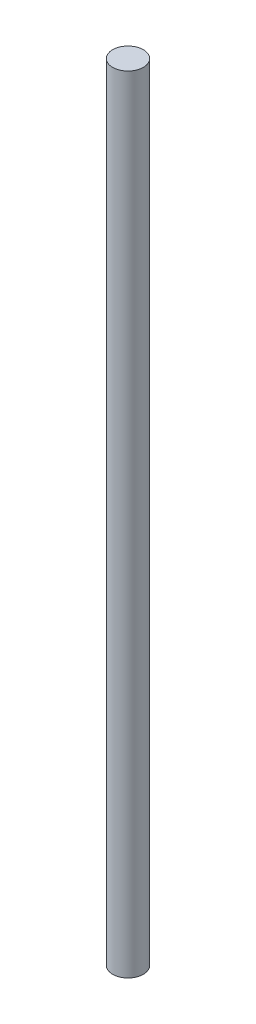
ISO-10303-21;
HEADER;
FILE_DESCRIPTION(('STEP AP214'),'2;1');
FILE_NAME('part.step','',(''),(''),'','','');
FILE_SCHEMA(('AUTOMOTIVE_DESIGN { 1 0 10303 214 1 1 1 1 }'));
ENDSEC;
DATA;
#1=APPLICATION_CONTEXT('core data for automotive mechanical design processes');
#2=APPLICATION_PROTOCOL_DEFINITION('international standard','automotive_design',2000,#1);
#3=PRODUCT_CONTEXT('',#1,'mechanical');
#4=PRODUCT('Part','Part','',(#3));
#5=PRODUCT_RELATED_PRODUCT_CATEGORY('part','',(#4));
#6=PRODUCT_DEFINITION_FORMATION('','',#4);
#7=PRODUCT_DEFINITION_CONTEXT('part definition',#1,'design');
#8=PRODUCT_DEFINITION('design','',#6,#7);
#9=PRODUCT_DEFINITION_SHAPE('','',#8);
#10=(LENGTH_UNIT() NAMED_UNIT(*) SI_UNIT(.MILLI.,.METRE.));
#11=(NAMED_UNIT(*) PLANE_ANGLE_UNIT() SI_UNIT($,.RADIAN.));
#12=(NAMED_UNIT(*) SI_UNIT($,.STERADIAN.) SOLID_ANGLE_UNIT());
#13=UNCERTAINTY_MEASURE_WITH_UNIT(LENGTH_MEASURE(1.E-05),#10,'distance_accuracy_value','');
#14=(GEOMETRIC_REPRESENTATION_CONTEXT(3) GLOBAL_UNCERTAINTY_ASSIGNED_CONTEXT((#13)) GLOBAL_UNIT_ASSIGNED_CONTEXT((#10,
#11,#12)) REPRESENTATION_CONTEXT('',''));
#15=CARTESIAN_POINT('',(0.,0.,0.));
#16=DIRECTION('',(0.,0.,1.));
#17=DIRECTION('',(1.,0.,0.));
#18=AXIS2_PLACEMENT_3D('',#15,#16,#17);
#19=CARTESIAN_POINT('',(0.,203.2,0.));
#20=DIRECTION('',(0.,-1.,0.));
#21=DIRECTION('',(0.,0.,-1.));
#22=AXIS2_PLACEMENT_3D('',#19,#20,#21);
#23=CYLINDRICAL_SURFACE('',#22,3.96875);
#24=CARTESIAN_POINT('',(0.,203.2,0.));
#25=DIRECTION('',(0.,1.,0.));
#26=DIRECTION('',(0.,0.,1.));
#27=AXIS2_PLACEMENT_3D('',#24,#25,#26);
#28=CIRCLE('',#27,3.96875);
#29=CARTESIAN_POINT('',(0.,203.2,3.96875));
#30=VERTEX_POINT('',#29);
#31=EDGE_CURVE('E10',#30,#30,#28,.T.);
#32=ORIENTED_EDGE('',*,*,#31,.F.);
#33=EDGE_LOOP('',(#32));
#34=FACE_BOUND('',#33,.T.);
#35=CARTESIAN_POINT('',(0.,0.,0.));
#36=DIRECTION('',(0.,1.,0.));
#37=DIRECTION('',(0.,0.,1.));
#38=AXIS2_PLACEMENT_3D('',#35,#36,#37);
#39=CIRCLE('',#38,3.96875);
#40=CARTESIAN_POINT('',(0.,0.,3.96875));
#41=VERTEX_POINT('',#40);
#42=EDGE_CURVE('E34',#41,#41,#39,.T.);
#43=ORIENTED_EDGE('',*,*,#42,.T.);
#44=EDGE_LOOP('',(#43));
#45=FACE_BOUND('',#44,.T.);
#46=ADVANCED_FACE('F31',(#34,#45),#23,.T.);
#47=CARTESIAN_POINT('',(0.,203.2,0.));
#48=DIRECTION('',(0.,1.,0.));
#49=DIRECTION('',(0.,0.,1.));
#50=AXIS2_PLACEMENT_3D('',#47,#48,#49);
#51=PLANE('',#50);
#52=ORIENTED_EDGE('',*,*,#31,.T.);
#53=EDGE_LOOP('',(#52));
#54=FACE_BOUND('',#53,.T.);
#55=ADVANCED_FACE('F46',(#54),#51,.T.);
#56=CARTESIAN_POINT('',(0.,0.,0.));
#57=DIRECTION('',(0.,1.,0.));
#58=DIRECTION('',(0.,0.,1.));
#59=AXIS2_PLACEMENT_3D('',#56,#57,#58);
#60=PLANE('',#59);
#61=ORIENTED_EDGE('',*,*,#42,.F.);
#62=EDGE_LOOP('',(#61));
#63=FACE_BOUND('',#62,.T.);
#64=ADVANCED_FACE('F44',(#63),#60,.F.);
#65=CLOSED_SHELL('',(#46,#55,#64));
#66=MANIFOLD_SOLID_BREP('B2',#65);
#67=ADVANCED_BREP_SHAPE_REPRESENTATION('',(#18,#66),#14);
#68=SHAPE_DEFINITION_REPRESENTATION(#9,#67);
ENDSEC;
END-ISO-10303-21;
